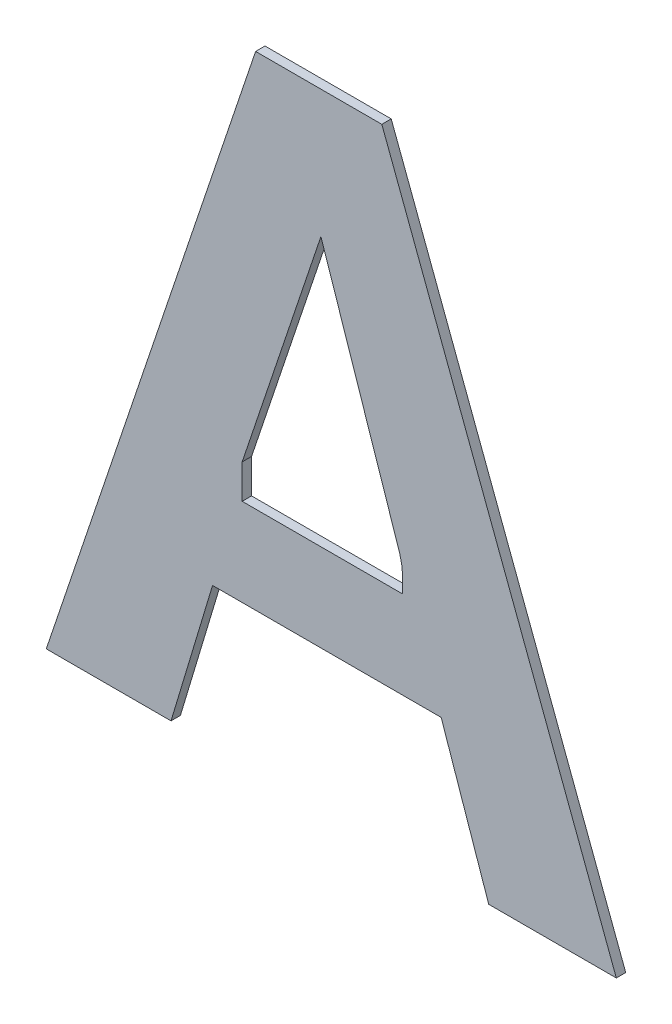
ISO-10303-21;
HEADER;
FILE_DESCRIPTION(('STEP AP214'),'2;1');
FILE_NAME('part.step','',(''),(''),'','','');
FILE_SCHEMA(('AUTOMOTIVE_DESIGN { 1 0 10303 214 1 1 1 1 }'));
ENDSEC;
DATA;
#1=APPLICATION_CONTEXT('core data for automotive mechanical design processes');
#2=APPLICATION_PROTOCOL_DEFINITION('international standard','automotive_design',2000,#1);
#3=PRODUCT_CONTEXT('',#1,'mechanical');
#4=PRODUCT('Part','Part','',(#3));
#5=PRODUCT_RELATED_PRODUCT_CATEGORY('part','',(#4));
#6=PRODUCT_DEFINITION_FORMATION('','',#4);
#7=PRODUCT_DEFINITION_CONTEXT('part definition',#1,'design');
#8=PRODUCT_DEFINITION('design','',#6,#7);
#9=PRODUCT_DEFINITION_SHAPE('','',#8);
#10=(LENGTH_UNIT() NAMED_UNIT(*) SI_UNIT(.MILLI.,.METRE.));
#11=(NAMED_UNIT(*) PLANE_ANGLE_UNIT() SI_UNIT($,.RADIAN.));
#12=(NAMED_UNIT(*) SI_UNIT($,.STERADIAN.) SOLID_ANGLE_UNIT());
#13=UNCERTAINTY_MEASURE_WITH_UNIT(LENGTH_MEASURE(1.E-05),#10,'distance_accuracy_value','');
#14=(GEOMETRIC_REPRESENTATION_CONTEXT(3) GLOBAL_UNCERTAINTY_ASSIGNED_CONTEXT((#13)) GLOBAL_UNIT_ASSIGNED_CONTEXT((#10,
#11,#12)) REPRESENTATION_CONTEXT('',''));
#15=CARTESIAN_POINT('',(0.,0.,0.));
#16=DIRECTION('',(0.,0.,1.));
#17=DIRECTION('',(1.,0.,0.));
#18=AXIS2_PLACEMENT_3D('',#15,#16,#17);
#19=CARTESIAN_POINT('',(3.3423762049818,-0.594267420766071,0.));
#20=CARTESIAN_POINT('',(3.3423762049818,-0.594267420766071,0.003));
#21=CARTESIAN_POINT('',(3.3433329229458,-0.597594244317504,0.));
#22=CARTESIAN_POINT('',(3.3433329229458,-0.597594244317504,0.003));
#23=CARTESIAN_POINT('',(3.343332926495,-0.598556673909994,0.));
#24=CARTESIAN_POINT('',(3.343332926495,-0.598556673909994,0.003));
#25=CARTESIAN_POINT('',(3.3433329509348,-0.605183797362393,0.));
#26=CARTESIAN_POINT('',(3.3433329509348,-0.605183797362393,0.003));
#27=B_SPLINE_SURFACE_WITH_KNOTS('',3,1,((#19,#20),(#21,#22),(#23,#24),(#25,#26)),.UNSPECIFIED.,
.F.,.F.,.F.,(4,4),(2,2),(0.,1.),(0.,0.0003),.UNSPECIFIED.);
#28=CARTESIAN_POINT('',(3.3423762049818,-0.594267420766071,0.));
#29=CARTESIAN_POINT('',(3.3433329229458,-0.597594244317504,0.));
#30=CARTESIAN_POINT('',(3.343332926495,-0.598556673909994,0.));
#31=CARTESIAN_POINT('',(3.3433329509348,-0.605183797362393,0.));
#32=B_SPLINE_CURVE_WITH_KNOTS('',3,(#28,#29,#30,#31),.UNSPECIFIED.,.F.,.F.,(4,4),(0.,1.),.UNSPECIFIED.);
#33=CARTESIAN_POINT('',(3.3423762049818,-0.594267420766071,0.));
#34=VERTEX_POINT('',#33);
#35=CARTESIAN_POINT('',(3.3433329509348,-0.605183797362393,0.));
#36=VERTEX_POINT('',#35);
#37=EDGE_CURVE('E11',#34,#36,#32,.T.);
#38=DIRECTION('',(0.,0.,1.));
#39=VECTOR('',#38,1.);
#40=CARTESIAN_POINT('',(3.3433329509348,-0.605183797362393,0.));
#41=LINE('',#40,#39);
#42=CARTESIAN_POINT('',(3.3433329509348,-0.605183797362393,0.003));
#43=VERTEX_POINT('',#42);
#44=EDGE_CURVE('E28',#36,#43,#41,.T.);
#45=CARTESIAN_POINT('',(3.3423762049818,-0.594267420766071,0.003));
#46=CARTESIAN_POINT('',(3.3433329229458,-0.597594244317504,0.003));
#47=CARTESIAN_POINT('',(3.343332926495,-0.598556673909994,0.003));
#48=CARTESIAN_POINT('',(3.3433329509348,-0.605183797362393,0.003));
#49=B_SPLINE_CURVE_WITH_KNOTS('',3,(#45,#46,#47,#48),.UNSPECIFIED.,.F.,.F.,(4,4),(0.,1.),.UNSPECIFIED.);
#50=CARTESIAN_POINT('',(3.3423762049818,-0.594267420766071,0.003));
#51=VERTEX_POINT('',#50);
#52=EDGE_CURVE('E227',#51,#43,#49,.T.);
#53=DIRECTION('',(0.,0.,1.));
#54=VECTOR('',#53,1.);
#55=CARTESIAN_POINT('',(3.3423762049818,-0.594267420766071,0.));
#56=LINE('',#55,#54);
#57=EDGE_CURVE('E224',#34,#51,#56,.T.);
#58=ORIENTED_EDGE('',*,*,#37,.T.);
#59=ORIENTED_EDGE('',*,*,#44,.T.);
#60=ORIENTED_EDGE('',*,*,#52,.F.);
#61=ORIENTED_EDGE('',*,*,#57,.F.);
#62=EDGE_LOOP('',(#58,#59,#60,#61));
#63=FACE_BOUND('',#62,.T.);
#64=ADVANCED_FACE('F17',(#63),#27,.T.);
#65=CARTESIAN_POINT('',(3.3172355737029,-0.519314427173439,0.));
#66=DIRECTION('',(-0.948088512389578,-0.318006560741939,0.));
#67=DIRECTION('',(0.318006560741939,-0.948088512389578,0.));
#68=AXIS2_PLACEMENT_3D('',#65,#66,#67);
#69=PLANE('',#68);
#70=DIRECTION('',(0.318006560741939,-0.948088512389578,0.));
#71=VECTOR('',#70,1.);
#72=CARTESIAN_POINT('',(3.3172355737029,-0.519314427173439,0.));
#73=LINE('',#72,#71);
#74=CARTESIAN_POINT('',(3.3172355737029,-0.519314427173439,0.));
#75=VERTEX_POINT('',#74);
#76=EDGE_CURVE('E221',#75,#34,#73,.T.);
#77=ORIENTED_EDGE('',*,*,#76,.T.);
#78=ORIENTED_EDGE('',*,*,#57,.T.);
#79=DIRECTION('',(0.318006560741939,-0.948088512389578,0.));
#80=VECTOR('',#79,1.);
#81=CARTESIAN_POINT('',(3.3172355737029,-0.519314427173439,0.003));
#82=LINE('',#81,#80);
#83=CARTESIAN_POINT('',(3.3172355737029,-0.519314427173439,0.003));
#84=VERTEX_POINT('',#83);
#85=EDGE_CURVE('E218',#84,#51,#82,.T.);
#86=ORIENTED_EDGE('',*,*,#85,.F.);
#87=DIRECTION('',(0.,0.,1.));
#88=VECTOR('',#87,1.);
#89=CARTESIAN_POINT('',(3.3172355737029,-0.519314427173439,0.));
#90=LINE('',#89,#88);
#91=EDGE_CURVE('E215',#75,#84,#90,.T.);
#92=ORIENTED_EDGE('',*,*,#91,.F.);
#93=EDGE_LOOP('',(#77,#78,#86,#92));
#94=FACE_BOUND('',#93,.T.);
#95=ADVANCED_FACE('F245',(#94),#69,.T.);
#96=CARTESIAN_POINT('',(3.2920665242271,-0.594267420766071,0.));
#97=DIRECTION('',(0.947980091673512,-0.318329618148673,0.));
#98=DIRECTION('',(0.318329618148673,0.947980091673512,0.));
#99=AXIS2_PLACEMENT_3D('',#96,#97,#98);
#100=PLANE('',#99);
#101=DIRECTION('',(0.318329618148673,0.947980091673512,0.));
#102=VECTOR('',#101,1.);
#103=CARTESIAN_POINT('',(3.2920665242271,-0.594267420766071,0.));
#104=LINE('',#103,#102);
#105=CARTESIAN_POINT('',(3.2920665242271,-0.594267420766071,0.));
#106=VERTEX_POINT('',#105);
#107=EDGE_CURVE('E212',#106,#75,#104,.T.);
#108=ORIENTED_EDGE('',*,*,#107,.T.);
#109=ORIENTED_EDGE('',*,*,#91,.T.);
#110=DIRECTION('',(0.318329618148673,0.947980091673512,0.));
#111=VECTOR('',#110,1.);
#112=CARTESIAN_POINT('',(3.2920665242271,-0.594267420766071,0.003));
#113=LINE('',#112,#111);
#114=CARTESIAN_POINT('',(3.2920665242271,-0.594267420766071,0.003));
#115=VERTEX_POINT('',#114);
#116=EDGE_CURVE('E209',#115,#84,#113,.T.);
#117=ORIENTED_EDGE('',*,*,#116,.F.);
#118=DIRECTION('',(0.,0.,1.));
#119=VECTOR('',#118,1.);
#120=CARTESIAN_POINT('',(3.2920665242271,-0.594267420766071,0.));
#121=LINE('',#120,#119);
#122=EDGE_CURVE('E206',#106,#115,#121,.T.);
#123=ORIENTED_EDGE('',*,*,#122,.F.);
#124=EDGE_LOOP('',(#108,#109,#117,#123));
#125=FACE_BOUND('',#124,.T.);
#126=ADVANCED_FACE('F242',(#125),#100,.T.);
#127=CARTESIAN_POINT('',(3.2920665242271,-0.605183797362393,0.));
#128=DIRECTION('',(1.,0.,0.));
#129=DIRECTION('',(0.,1.,0.));
#130=AXIS2_PLACEMENT_3D('',#127,#128,#129);
#131=PLANE('',#130);
#132=DIRECTION('',(0.,1.,0.));
#133=VECTOR('',#132,1.);
#134=CARTESIAN_POINT('',(3.2920665242271,-0.605183797362393,0.));
#135=LINE('',#134,#133);
#136=CARTESIAN_POINT('',(3.2920665242271,-0.605183797362393,0.));
#137=VERTEX_POINT('',#136);
#138=EDGE_CURVE('E203',#137,#106,#135,.T.);
#139=ORIENTED_EDGE('',*,*,#138,.T.);
#140=ORIENTED_EDGE('',*,*,#122,.T.);
#141=DIRECTION('',(0.,1.,0.));
#142=VECTOR('',#141,1.);
#143=CARTESIAN_POINT('',(3.2920665242271,-0.605183797362393,0.003));
#144=LINE('',#143,#142);
#145=CARTESIAN_POINT('',(3.2920665242271,-0.605183797362393,0.003));
#146=VERTEX_POINT('',#145);
#147=EDGE_CURVE('E200',#146,#115,#144,.T.);
#148=ORIENTED_EDGE('',*,*,#147,.F.);
#149=DIRECTION('',(0.,0.,1.));
#150=VECTOR('',#149,1.);
#151=CARTESIAN_POINT('',(3.2920665242271,-0.605183797362393,0.));
#152=LINE('',#151,#150);
#153=EDGE_CURVE('E197',#137,#146,#152,.T.);
#154=ORIENTED_EDGE('',*,*,#153,.F.);
#155=EDGE_LOOP('',(#139,#140,#148,#154));
#156=FACE_BOUND('',#155,.T.);
#157=ADVANCED_FACE('F239',(#156),#131,.T.);
#158=CARTESIAN_POINT('',(3.3433329509348,-0.605183797362393,0.));
#159=DIRECTION('',(0.,1.,0.));
#160=DIRECTION('',(-1.,0.,0.));
#161=AXIS2_PLACEMENT_3D('',#158,#159,#160);
#162=PLANE('',#161);
#163=DIRECTION('',(-1.,0.,0.));
#164=VECTOR('',#163,1.);
#165=CARTESIAN_POINT('',(3.3433329509348,-0.605183797362393,0.));
#166=LINE('',#165,#164);
#167=EDGE_CURVE('E194',#36,#137,#166,.T.);
#168=ORIENTED_EDGE('',*,*,#167,.T.);
#169=ORIENTED_EDGE('',*,*,#153,.T.);
#170=DIRECTION('',(-1.,0.,0.));
#171=VECTOR('',#170,1.);
#172=CARTESIAN_POINT('',(3.3433329509348,-0.605183797362393,0.003));
#173=LINE('',#172,#171);
#174=EDGE_CURVE('E191',#43,#146,#173,.T.);
#175=ORIENTED_EDGE('',*,*,#174,.F.);
#176=ORIENTED_EDGE('',*,*,#44,.F.);
#177=EDGE_LOOP('',(#168,#169,#175,#176));
#178=FACE_BOUND('',#177,.T.);
#179=ADVANCED_FACE('F236',(#178),#162,.T.);
#180=CARTESIAN_POINT('',(3.4116597683485,-0.677335704041417,0.));
#181=DIRECTION('',(0.935715306752692,0.352756098046107,0.));
#182=DIRECTION('',(-0.352756098046107,0.935715306752692,0.));
#183=AXIS2_PLACEMENT_3D('',#180,#181,#182);
#184=PLANE('',#183);
#185=DIRECTION('',(-0.352756098046107,0.935715306752692,0.));
#186=VECTOR('',#185,1.);
#187=CARTESIAN_POINT('',(3.4116597683485,-0.677335704041417,0.));
#188=LINE('',#187,#186);
#189=CARTESIAN_POINT('',(3.4116597683485,-0.677335704041417,0.));
#190=VERTEX_POINT('',#189);
#191=CARTESIAN_POINT('',(3.3367020383892,-0.478504002276747,0.));
#192=VERTEX_POINT('',#191);
#193=EDGE_CURVE('E189',#190,#192,#188,.T.);
#194=ORIENTED_EDGE('',*,*,#193,.T.);
#195=DIRECTION('',(0.,0.,1.));
#196=VECTOR('',#195,1.);
#197=CARTESIAN_POINT('',(3.3367020383892,-0.478504002276747,0.));
#198=LINE('',#197,#196);
#199=CARTESIAN_POINT('',(3.3367020383892,-0.478504002276747,0.003));
#200=VERTEX_POINT('',#199);
#201=EDGE_CURVE('E187',#192,#200,#198,.T.);
#202=ORIENTED_EDGE('',*,*,#201,.T.);
#203=DIRECTION('',(-0.352756098046107,0.935715306752692,0.));
#204=VECTOR('',#203,1.);
#205=CARTESIAN_POINT('',(3.4116597683485,-0.677335704041417,0.003));
#206=LINE('',#205,#204);
#207=CARTESIAN_POINT('',(3.4116597683485,-0.677335704041417,0.003));
#208=VERTEX_POINT('',#207);
#209=EDGE_CURVE('E137',#208,#200,#206,.T.);
#210=ORIENTED_EDGE('',*,*,#209,.F.);
#211=DIRECTION('',(0.,0.,1.));
#212=VECTOR('',#211,1.);
#213=CARTESIAN_POINT('',(3.4116597683485,-0.677335704041417,0.));
#214=LINE('',#213,#212);
#215=EDGE_CURVE('E183',#190,#208,#214,.T.);
#216=ORIENTED_EDGE('',*,*,#215,.F.);
#217=EDGE_LOOP('',(#194,#202,#210,#216));
#218=FACE_BOUND('',#217,.T.);
#219=ADVANCED_FACE('F268',(#218),#184,.T.);
#220=CARTESIAN_POINT('',(3.3708701834622,-0.677335704041417,0.));
#221=DIRECTION('',(0.,-1.,0.));
#222=DIRECTION('',(1.,0.,0.));
#223=AXIS2_PLACEMENT_3D('',#220,#221,#222);
#224=PLANE('',#223);
#225=DIRECTION('',(1.,0.,0.));
#226=VECTOR('',#225,1.);
#227=CARTESIAN_POINT('',(3.3708701834622,-0.677335704041417,0.));
#228=LINE('',#227,#226);
#229=CARTESIAN_POINT('',(3.3708701834622,-0.677335704041417,0.));
#230=VERTEX_POINT('',#229);
#231=EDGE_CURVE('E180',#230,#190,#228,.T.);
#232=ORIENTED_EDGE('',*,*,#231,.T.);
#233=ORIENTED_EDGE('',*,*,#215,.T.);
#234=DIRECTION('',(1.,0.,0.));
#235=VECTOR('',#234,1.);
#236=CARTESIAN_POINT('',(3.3708701834622,-0.677335704041417,0.003));
#237=LINE('',#236,#235);
#238=CARTESIAN_POINT('',(3.3708701834622,-0.677335704041417,0.003));
#239=VERTEX_POINT('',#238);
#240=EDGE_CURVE('E178',#239,#208,#237,.T.);
#241=ORIENTED_EDGE('',*,*,#240,.F.);
#242=DIRECTION('',(0.,0.,1.));
#243=VECTOR('',#242,1.);
#244=CARTESIAN_POINT('',(3.3708701834622,-0.677335704041417,0.));
#245=LINE('',#244,#243);
#246=EDGE_CURVE('E175',#230,#239,#245,.T.);
#247=ORIENTED_EDGE('',*,*,#246,.F.);
#248=EDGE_LOOP('',(#232,#233,#241,#247));
#249=FACE_BOUND('',#248,.T.);
#250=ADVANCED_FACE('F271',(#249),#224,.T.);
#251=CARTESIAN_POINT('',(3.355666448269,-0.633198455593453,0.));
#252=DIRECTION('',(-0.945478596235465,-0.325684239809996,0.));
#253=DIRECTION('',(0.325684239809996,-0.945478596235465,0.));
#254=AXIS2_PLACEMENT_3D('',#251,#252,#253);
#255=PLANE('',#254);
#256=DIRECTION('',(0.325684239809996,-0.945478596235465,0.));
#257=VECTOR('',#256,1.);
#258=CARTESIAN_POINT('',(3.355666448269,-0.633198455593453,0.));
#259=LINE('',#258,#257);
#260=CARTESIAN_POINT('',(3.355666448269,-0.633198455593453,0.));
#261=VERTEX_POINT('',#260);
#262=EDGE_CURVE('E172',#261,#230,#259,.T.);
#263=ORIENTED_EDGE('',*,*,#262,.T.);
#264=ORIENTED_EDGE('',*,*,#246,.T.);
#265=DIRECTION('',(0.325684239809996,-0.945478596235465,0.));
#266=VECTOR('',#265,1.);
#267=CARTESIAN_POINT('',(3.355666448269,-0.633198455593453,0.003));
#268=LINE('',#267,#266);
#269=CARTESIAN_POINT('',(3.355666448269,-0.633198455593453,0.003));
#270=VERTEX_POINT('',#269);
#271=EDGE_CURVE('E169',#270,#239,#268,.T.);
#272=ORIENTED_EDGE('',*,*,#271,.F.);
#273=DIRECTION('',(0.,0.,1.));
#274=VECTOR('',#273,1.);
#275=CARTESIAN_POINT('',(3.355666448269,-0.633198455593453,0.));
#276=LINE('',#275,#274);
#277=EDGE_CURVE('E166',#261,#270,#276,.T.);
#278=ORIENTED_EDGE('',*,*,#277,.F.);
#279=EDGE_LOOP('',(#263,#264,#272,#278));
#280=FACE_BOUND('',#279,.T.);
#281=ADVANCED_FACE('F275',(#280),#255,.T.);
#282=CARTESIAN_POINT('',(3.2825975811123,-0.633198455593453,0.));
#283=DIRECTION('',(0.,-1.,0.));
#284=DIRECTION('',(1.,0.,0.));
#285=AXIS2_PLACEMENT_3D('',#282,#283,#284);
#286=PLANE('',#285);
#287=DIRECTION('',(1.,0.,0.));
#288=VECTOR('',#287,1.);
#289=CARTESIAN_POINT('',(3.2825975811123,-0.633198455593453,0.));
#290=LINE('',#289,#288);
#291=CARTESIAN_POINT('',(3.2825975811123,-0.633198455593453,0.));
#292=VERTEX_POINT('',#291);
#293=EDGE_CURVE('E163',#292,#261,#290,.T.);
#294=ORIENTED_EDGE('',*,*,#293,.T.);
#295=ORIENTED_EDGE('',*,*,#277,.T.);
#296=DIRECTION('',(1.,0.,0.));
#297=VECTOR('',#296,1.);
#298=CARTESIAN_POINT('',(3.2825975811123,-0.633198455593453,0.003));
#299=LINE('',#298,#297);
#300=CARTESIAN_POINT('',(3.2825975811123,-0.633198455593453,0.003));
#301=VERTEX_POINT('',#300);
#302=EDGE_CURVE('E160',#301,#270,#299,.T.);
#303=ORIENTED_EDGE('',*,*,#302,.F.);
#304=DIRECTION('',(0.,0.,1.));
#305=VECTOR('',#304,1.);
#306=CARTESIAN_POINT('',(3.2825975811123,-0.633198455593453,0.));
#307=LINE('',#306,#305);
#308=EDGE_CURVE('E157',#292,#301,#307,.T.);
#309=ORIENTED_EDGE('',*,*,#308,.F.);
#310=EDGE_LOOP('',(#294,#295,#303,#309));
#311=FACE_BOUND('',#310,.T.);
#312=ADVANCED_FACE('F279',(#311),#286,.T.);
#313=CARTESIAN_POINT('',(3.2693215469231,-0.677335704041417,0.));
#314=DIRECTION('',(0.957617870270537,-0.288041688889858,0.));
#315=DIRECTION('',(0.288041688889858,0.957617870270537,0.));
#316=AXIS2_PLACEMENT_3D('',#313,#314,#315);
#317=PLANE('',#316);
#318=DIRECTION('',(0.288041688889858,0.957617870270537,0.));
#319=VECTOR('',#318,1.);
#320=CARTESIAN_POINT('',(3.2693215469231,-0.677335704041417,0.));
#321=LINE('',#320,#319);
#322=CARTESIAN_POINT('',(3.2693215469231,-0.677335704041417,0.));
#323=VERTEX_POINT('',#322);
#324=EDGE_CURVE('E154',#323,#292,#321,.T.);
#325=ORIENTED_EDGE('',*,*,#324,.T.);
#326=ORIENTED_EDGE('',*,*,#308,.T.);
#327=DIRECTION('',(0.288041688889858,0.957617870270537,0.));
#328=VECTOR('',#327,1.);
#329=CARTESIAN_POINT('',(3.2693215469231,-0.677335704041417,0.003));
#330=LINE('',#329,#328);
#331=CARTESIAN_POINT('',(3.2693215469231,-0.677335704041417,0.003));
#332=VERTEX_POINT('',#331);
#333=EDGE_CURVE('E151',#332,#301,#330,.T.);
#334=ORIENTED_EDGE('',*,*,#333,.F.);
#335=DIRECTION('',(0.,0.,1.));
#336=VECTOR('',#335,1.);
#337=CARTESIAN_POINT('',(3.2693215469231,-0.677335704041417,0.));
#338=LINE('',#337,#336);
#339=EDGE_CURVE('E148',#323,#332,#338,.T.);
#340=ORIENTED_EDGE('',*,*,#339,.F.);
#341=EDGE_LOOP('',(#325,#326,#334,#340));
#342=FACE_BOUND('',#341,.T.);
#343=ADVANCED_FACE('F283',(#342),#317,.T.);
#344=CARTESIAN_POINT('',(3.2294508170616,-0.677335704041417,0.));
#345=DIRECTION('',(0.,-1.,0.));
#346=DIRECTION('',(1.,0.,0.));
#347=AXIS2_PLACEMENT_3D('',#344,#345,#346);
#348=PLANE('',#347);
#349=DIRECTION('',(1.,0.,0.));
#350=VECTOR('',#349,1.);
#351=CARTESIAN_POINT('',(3.2294508170616,-0.677335704041417,0.));
#352=LINE('',#351,#350);
#353=CARTESIAN_POINT('',(3.2294508170616,-0.677335704041417,0.));
#354=VERTEX_POINT('',#353);
#355=EDGE_CURVE('E145',#354,#323,#352,.T.);
#356=ORIENTED_EDGE('',*,*,#355,.T.);
#357=ORIENTED_EDGE('',*,*,#339,.T.);
#358=DIRECTION('',(1.,0.,0.));
#359=VECTOR('',#358,1.);
#360=CARTESIAN_POINT('',(3.2294508170616,-0.677335704041417,0.003));
#361=LINE('',#360,#359);
#362=CARTESIAN_POINT('',(3.2294508170616,-0.677335704041417,0.003));
#363=VERTEX_POINT('',#362);
#364=EDGE_CURVE('E143',#363,#332,#361,.T.);
#365=ORIENTED_EDGE('',*,*,#364,.F.);
#366=DIRECTION('',(0.,0.,1.));
#367=VECTOR('',#366,1.);
#368=CARTESIAN_POINT('',(3.2294508170616,-0.677335704041417,0.));
#369=LINE('',#368,#367);
#370=EDGE_CURVE('E119',#354,#363,#369,.T.);
#371=ORIENTED_EDGE('',*,*,#370,.F.);
#372=EDGE_LOOP('',(#356,#357,#365,#371));
#373=FACE_BOUND('',#372,.T.);
#374=ADVANCED_FACE('F287',(#373),#348,.T.);
#375=CARTESIAN_POINT('',(3.2963576719171,-0.478504002276747,0.));
#376=DIRECTION('',(-0.947779080860674,0.318927599750942,0.));
#377=DIRECTION('',(-0.318927599750942,-0.947779080860674,0.));
#378=AXIS2_PLACEMENT_3D('',#375,#376,#377);
#379=PLANE('',#378);
#380=DIRECTION('',(-0.318927599750942,-0.947779080860674,0.));
#381=VECTOR('',#380,1.);
#382=CARTESIAN_POINT('',(3.2963576719171,-0.478504002276747,0.));
#383=LINE('',#382,#381);
#384=CARTESIAN_POINT('',(3.2963576719171,-0.478504002276747,0.));
#385=VERTEX_POINT('',#384);
#386=EDGE_CURVE('E123',#385,#354,#383,.T.);
#387=ORIENTED_EDGE('',*,*,#386,.T.);
#388=ORIENTED_EDGE('',*,*,#370,.T.);
#389=DIRECTION('',(-0.318927599750942,-0.947779080860674,0.));
#390=VECTOR('',#389,1.);
#391=CARTESIAN_POINT('',(3.2963576719171,-0.478504002276747,0.003));
#392=LINE('',#391,#390);
#393=CARTESIAN_POINT('',(3.2963576719171,-0.478504002276747,0.003));
#394=VERTEX_POINT('',#393);
#395=EDGE_CURVE('E112',#394,#363,#392,.T.);
#396=ORIENTED_EDGE('',*,*,#395,.F.);
#397=DIRECTION('',(0.,0.,1.));
#398=VECTOR('',#397,1.);
#399=CARTESIAN_POINT('',(3.2963576719171,-0.478504002276747,0.));
#400=LINE('',#399,#398);
#401=EDGE_CURVE('E116',#385,#394,#400,.T.);
#402=ORIENTED_EDGE('',*,*,#401,.F.);
#403=EDGE_LOOP('',(#387,#388,#396,#402));
#404=FACE_BOUND('',#403,.T.);
#405=ADVANCED_FACE('F115',(#404),#379,.T.);
#406=CARTESIAN_POINT('',(3.3367020383892,-0.478504002276747,0.));
#407=DIRECTION('',(0.,1.,0.));
#408=DIRECTION('',(-1.,0.,0.));
#409=AXIS2_PLACEMENT_3D('',#406,#407,#408);
#410=PLANE('',#409);
#411=DIRECTION('',(-1.,0.,0.));
#412=VECTOR('',#411,1.);
#413=CARTESIAN_POINT('',(3.3367020383892,-0.478504002276747,0.));
#414=LINE('',#413,#412);
#415=EDGE_CURVE('E131',#192,#385,#414,.T.);
#416=ORIENTED_EDGE('',*,*,#415,.T.);
#417=ORIENTED_EDGE('',*,*,#401,.T.);
#418=DIRECTION('',(-1.,0.,0.));
#419=VECTOR('',#418,1.);
#420=CARTESIAN_POINT('',(3.3367020383892,-0.478504002276747,0.003));
#421=LINE('',#420,#419);
#422=EDGE_CURVE('E129',#200,#394,#421,.T.);
#423=ORIENTED_EDGE('',*,*,#422,.F.);
#424=ORIENTED_EDGE('',*,*,#201,.F.);
#425=EDGE_LOOP('',(#416,#417,#423,#424));
#426=FACE_BOUND('',#425,.T.);
#427=ADVANCED_FACE('F127',(#426),#410,.T.);
#428=CARTESIAN_POINT('',(3.3205552927051,-0.577919853159082,0.003));
#429=DIRECTION('',(0.,0.,1.));
#430=DIRECTION('',(1.,0.,0.));
#431=AXIS2_PLACEMENT_3D('',#428,#429,#430);
#432=PLANE('',#431);
#433=ORIENTED_EDGE('',*,*,#422,.T.);
#434=ORIENTED_EDGE('',*,*,#395,.T.);
#435=ORIENTED_EDGE('',*,*,#364,.T.);
#436=ORIENTED_EDGE('',*,*,#333,.T.);
#437=ORIENTED_EDGE('',*,*,#302,.T.);
#438=ORIENTED_EDGE('',*,*,#271,.T.);
#439=ORIENTED_EDGE('',*,*,#240,.T.);
#440=ORIENTED_EDGE('',*,*,#209,.T.);
#441=EDGE_LOOP('',(#433,#434,#435,#436,#437,#438,#439,#440));
#442=FACE_BOUND('',#441,.T.);
#443=ORIENTED_EDGE('',*,*,#174,.T.);
#444=ORIENTED_EDGE('',*,*,#147,.T.);
#445=ORIENTED_EDGE('',*,*,#116,.T.);
#446=ORIENTED_EDGE('',*,*,#85,.T.);
#447=ORIENTED_EDGE('',*,*,#52,.T.);
#448=EDGE_LOOP('',(#443,#444,#445,#446,#447));
#449=FACE_BOUND('',#448,.T.);
#450=ADVANCED_FACE('F134',(#442,#449),#432,.T.);
#451=CARTESIAN_POINT('',(3.3205552927051,-0.577919853159082,0.));
#452=DIRECTION('',(0.,0.,1.));
#453=DIRECTION('',(1.,0.,0.));
#454=AXIS2_PLACEMENT_3D('',#451,#452,#453);
#455=PLANE('',#454);
#456=ORIENTED_EDGE('',*,*,#415,.F.);
#457=ORIENTED_EDGE('',*,*,#193,.F.);
#458=ORIENTED_EDGE('',*,*,#231,.F.);
#459=ORIENTED_EDGE('',*,*,#262,.F.);
#460=ORIENTED_EDGE('',*,*,#293,.F.);
#461=ORIENTED_EDGE('',*,*,#324,.F.);
#462=ORIENTED_EDGE('',*,*,#355,.F.);
#463=ORIENTED_EDGE('',*,*,#386,.F.);
#464=EDGE_LOOP('',(#456,#457,#458,#459,#460,#461,#462,#463));
#465=FACE_BOUND('',#464,.T.);
#466=ORIENTED_EDGE('',*,*,#167,.F.);
#467=ORIENTED_EDGE('',*,*,#37,.F.);
#468=ORIENTED_EDGE('',*,*,#76,.F.);
#469=ORIENTED_EDGE('',*,*,#107,.F.);
#470=ORIENTED_EDGE('',*,*,#138,.F.);
#471=EDGE_LOOP('',(#466,#467,#468,#469,#470));
#472=FACE_BOUND('',#471,.T.);
#473=ADVANCED_FACE('F246',(#465,#472),#455,.F.);
#474=CLOSED_SHELL('',(#64,#95,#126,#157,#179,#219,#250,#281,#312,#343,#374,#405,#427,#450,#473));
#475=MANIFOLD_SOLID_BREP('B1',#474);
#476=ADVANCED_BREP_SHAPE_REPRESENTATION('',(#18,#475),#14);
#477=SHAPE_DEFINITION_REPRESENTATION(#9,#476);
ENDSEC;
END-ISO-10303-21;
